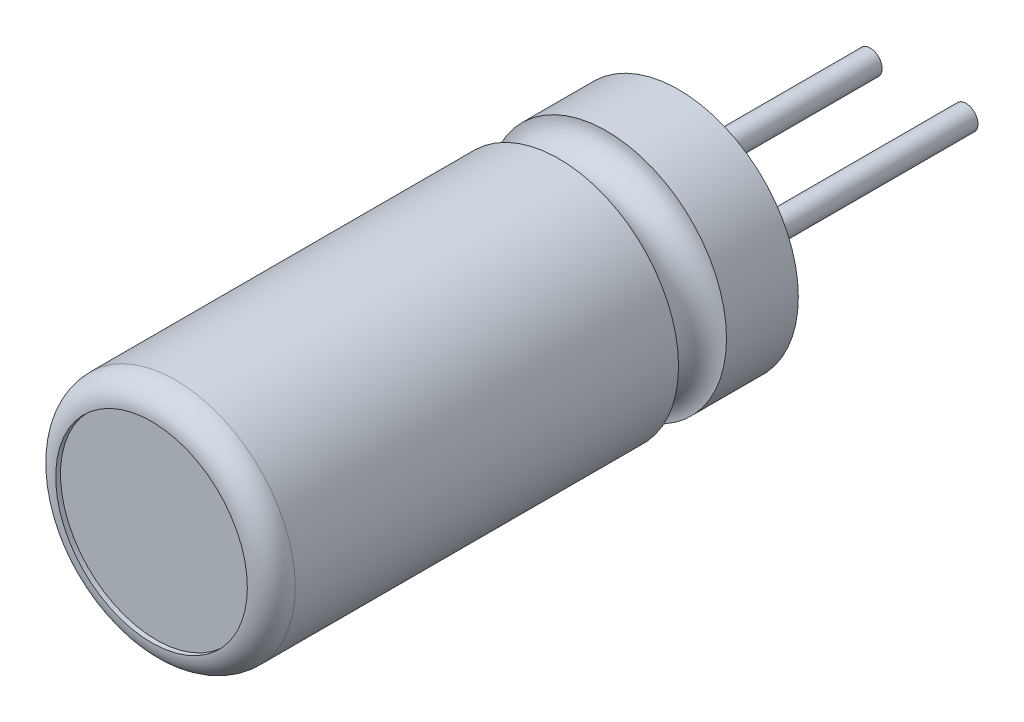
ISO-10303-21;
HEADER;
FILE_DESCRIPTION(('STEP AP214'),'2;1');
FILE_NAME('part.step','',(''),(''),'','','');
FILE_SCHEMA(('AUTOMOTIVE_DESIGN { 1 0 10303 214 1 1 1 1 }'));
ENDSEC;
DATA;
#1=APPLICATION_CONTEXT('core data for automotive mechanical design processes');
#2=APPLICATION_PROTOCOL_DEFINITION('international standard','automotive_design',2000,#1);
#3=PRODUCT_CONTEXT('',#1,'mechanical');
#4=PRODUCT('Part','Part','',(#3));
#5=PRODUCT_RELATED_PRODUCT_CATEGORY('part','',(#4));
#6=PRODUCT_DEFINITION_FORMATION('','',#4);
#7=PRODUCT_DEFINITION_CONTEXT('part definition',#1,'design');
#8=PRODUCT_DEFINITION('design','',#6,#7);
#9=PRODUCT_DEFINITION_SHAPE('','',#8);
#10=(LENGTH_UNIT() NAMED_UNIT(*) SI_UNIT(.MILLI.,.METRE.));
#11=(NAMED_UNIT(*) PLANE_ANGLE_UNIT() SI_UNIT($,.RADIAN.));
#12=(NAMED_UNIT(*) SI_UNIT($,.STERADIAN.) SOLID_ANGLE_UNIT());
#13=UNCERTAINTY_MEASURE_WITH_UNIT(LENGTH_MEASURE(1.E-05),#10,'distance_accuracy_value','');
#14=(GEOMETRIC_REPRESENTATION_CONTEXT(3) GLOBAL_UNCERTAINTY_ASSIGNED_CONTEXT((#13)) GLOBAL_UNIT_ASSIGNED_CONTEXT((#10,
#11,#12)) REPRESENTATION_CONTEXT('',''));
#15=CARTESIAN_POINT('',(0.,0.,0.));
#16=DIRECTION('',(0.,0.,1.));
#17=DIRECTION('',(1.,0.,0.));
#18=AXIS2_PLACEMENT_3D('',#15,#16,#17);
#19=CARTESIAN_POINT('',(0.,0.,0.));
#20=DIRECTION('',(0.,0.,1.));
#21=DIRECTION('',(1.,0.,0.));
#22=AXIS2_PLACEMENT_3D('',#19,#20,#21);
#23=PLANE('',#22);
#24=CARTESIAN_POINT('',(-1.,0.,0.));
#25=DIRECTION('',(0.,0.,1.));
#26=DIRECTION('',(1.,0.,0.));
#27=AXIS2_PLACEMENT_3D('',#24,#25,#26);
#28=CIRCLE('',#27,0.25);
#29=CARTESIAN_POINT('',(-0.75,0.,0.));
#30=VERTEX_POINT('',#29);
#31=EDGE_CURVE('E37',#30,#30,#28,.F.);
#32=ORIENTED_EDGE('',*,*,#31,.F.);
#33=EDGE_LOOP('',(#32));
#34=FACE_BOUND('',#33,.T.);
#35=CARTESIAN_POINT('',(0.,0.,0.));
#36=DIRECTION('',(0.,0.,1.));
#37=DIRECTION('',(1.,0.,0.));
#38=AXIS2_PLACEMENT_3D('',#35,#36,#37);
#39=CIRCLE('',#38,2.5);
#40=CARTESIAN_POINT('',(2.5,0.,0.));
#41=VERTEX_POINT('',#40);
#42=EDGE_CURVE('E41',#41,#41,#39,.T.);
#43=ORIENTED_EDGE('',*,*,#42,.F.);
#44=EDGE_LOOP('',(#43));
#45=FACE_BOUND('',#44,.T.);
#46=CARTESIAN_POINT('',(1.,0.,0.));
#47=DIRECTION('',(0.,0.,1.));
#48=DIRECTION('',(1.,0.,0.));
#49=AXIS2_PLACEMENT_3D('',#46,#47,#48);
#50=CIRCLE('',#49,0.25);
#51=CARTESIAN_POINT('',(1.25,0.,0.));
#52=VERTEX_POINT('',#51);
#53=EDGE_CURVE('E10',#52,#52,#50,.F.);
#54=ORIENTED_EDGE('',*,*,#53,.F.);
#55=EDGE_LOOP('',(#54));
#56=FACE_BOUND('',#55,.T.);
#57=ADVANCED_FACE('F31',(#34,#45,#56),#23,.F.);
#58=CARTESIAN_POINT('',(0.,0.,11.));
#59=DIRECTION('',(0.,0.,1.));
#60=DIRECTION('',(1.,0.,0.));
#61=AXIS2_PLACEMENT_3D('',#58,#59,#60);
#62=CYLINDRICAL_SURFACE('',#61,2.5);
#63=CARTESIAN_POINT('',(0.,0.,1.5));
#64=DIRECTION('',(0.,0.,1.));
#65=DIRECTION('',(1.,0.,0.));
#66=AXIS2_PLACEMENT_3D('',#63,#64,#65);
#67=CIRCLE('',#66,2.5);
#68=CARTESIAN_POINT('',(2.5,0.,1.5));
#69=VERTEX_POINT('',#68);
#70=EDGE_CURVE('E45',#69,#69,#67,.T.);
#71=ORIENTED_EDGE('',*,*,#70,.F.);
#72=EDGE_LOOP('',(#71));
#73=FACE_BOUND('',#72,.T.);
#74=ORIENTED_EDGE('',*,*,#42,.T.);
#75=EDGE_LOOP('',(#74));
#76=FACE_BOUND('',#75,.T.);
#77=ADVANCED_FACE('F84',(#73,#76),#62,.T.);
#78=CARTESIAN_POINT('',(0.,0.,2.));
#79=DIRECTION('',(0.,0.,1.));
#80=DIRECTION('',(1.,0.,0.));
#81=AXIS2_PLACEMENT_3D('',#78,#79,#80);
#82=TOROIDAL_SURFACE('',#81,2.5,0.5);
#83=CARTESIAN_POINT('',(0.,0.,2.5));
#84=DIRECTION('',(0.,0.,1.));
#85=DIRECTION('',(1.,0.,0.));
#86=AXIS2_PLACEMENT_3D('',#83,#84,#85);
#87=CIRCLE('',#86,2.5);
#88=CARTESIAN_POINT('',(2.5,0.,2.5));
#89=VERTEX_POINT('',#88);
#90=EDGE_CURVE('E50',#89,#89,#87,.T.);
#91=ORIENTED_EDGE('',*,*,#90,.F.);
#92=EDGE_LOOP('',(#91));
#93=FACE_BOUND('',#92,.T.);
#94=ORIENTED_EDGE('',*,*,#70,.T.);
#95=EDGE_LOOP('',(#94));
#96=FACE_BOUND('',#95,.T.);
#97=ADVANCED_FACE('F89',(#93,#96),#82,.F.);
#98=CARTESIAN_POINT('',(0.,0.,11.));
#99=DIRECTION('',(0.,0.,1.));
#100=DIRECTION('',(1.,0.,0.));
#101=AXIS2_PLACEMENT_3D('',#98,#99,#100);
#102=CYLINDRICAL_SURFACE('',#101,2.5);
#103=CARTESIAN_POINT('',(0.,0.,10.5));
#104=DIRECTION('',(0.,0.,1.));
#105=DIRECTION('',(1.,0.,0.));
#106=AXIS2_PLACEMENT_3D('',#103,#104,#105);
#107=CIRCLE('',#106,2.5);
#108=CARTESIAN_POINT('',(2.5,0.,10.5));
#109=VERTEX_POINT('',#108);
#110=EDGE_CURVE('E53',#109,#109,#107,.T.);
#111=ORIENTED_EDGE('',*,*,#110,.F.);
#112=EDGE_LOOP('',(#111));
#113=FACE_BOUND('',#112,.T.);
#114=ORIENTED_EDGE('',*,*,#90,.T.);
#115=EDGE_LOOP('',(#114));
#116=FACE_BOUND('',#115,.T.);
#117=ADVANCED_FACE('F98',(#113,#116),#102,.T.);
#118=CARTESIAN_POINT('',(0.,0.,10.5));
#119=DIRECTION('',(0.,0.,1.));
#120=DIRECTION('',(1.,0.,0.));
#121=AXIS2_PLACEMENT_3D('',#118,#119,#120);
#122=TOROIDAL_SURFACE('',#121,2.,0.500000000000001);
#123=CARTESIAN_POINT('',(0.,0.,11.));
#124=DIRECTION('',(0.,0.,1.));
#125=DIRECTION('',(1.,0.,0.));
#126=AXIS2_PLACEMENT_3D('',#123,#124,#125);
#127=CIRCLE('',#126,2.);
#128=CARTESIAN_POINT('',(2.,0.,11.));
#129=VERTEX_POINT('',#128);
#130=EDGE_CURVE('E57',#129,#129,#127,.T.);
#131=ORIENTED_EDGE('',*,*,#130,.F.);
#132=EDGE_LOOP('',(#131));
#133=FACE_BOUND('',#132,.T.);
#134=ORIENTED_EDGE('',*,*,#110,.T.);
#135=EDGE_LOOP('',(#134));
#136=FACE_BOUND('',#135,.T.);
#137=ADVANCED_FACE('F105',(#133,#136),#122,.T.);
#138=CARTESIAN_POINT('',(0.,0.,10.9));
#139=DIRECTION('',(0.,0.,1.));
#140=DIRECTION('',(1.,0.,0.));
#141=AXIS2_PLACEMENT_3D('',#138,#139,#140);
#142=CYLINDRICAL_SURFACE('',#141,2.);
#143=CARTESIAN_POINT('',(0.,0.,10.9));
#144=DIRECTION('',(0.,0.,1.));
#145=DIRECTION('',(1.,0.,0.));
#146=AXIS2_PLACEMENT_3D('',#143,#144,#145);
#147=CIRCLE('',#146,2.);
#148=CARTESIAN_POINT('',(2.,0.,10.9));
#149=VERTEX_POINT('',#148);
#150=EDGE_CURVE('E56',#149,#149,#147,.T.);
#151=ORIENTED_EDGE('',*,*,#150,.F.);
#152=EDGE_LOOP('',(#151));
#153=FACE_BOUND('',#152,.T.);
#154=ORIENTED_EDGE('',*,*,#130,.T.);
#155=EDGE_LOOP('',(#154));
#156=FACE_BOUND('',#155,.T.);
#157=ADVANCED_FACE('F109',(#153,#156),#142,.F.);
#158=CARTESIAN_POINT('',(0.,0.,10.9));
#159=DIRECTION('',(0.,0.,1.));
#160=DIRECTION('',(1.,0.,0.));
#161=AXIS2_PLACEMENT_3D('',#158,#159,#160);
#162=PLANE('',#161);
#163=ORIENTED_EDGE('',*,*,#150,.T.);
#164=EDGE_LOOP('',(#163));
#165=FACE_BOUND('',#164,.T.);
#166=ADVANCED_FACE('F113',(#165),#162,.T.);
#167=CARTESIAN_POINT('',(-1.,0.,-5.));
#168=DIRECTION('',(0.,0.,1.));
#169=DIRECTION('',(1.,0.,0.));
#170=AXIS2_PLACEMENT_3D('',#167,#168,#169);
#171=CYLINDRICAL_SURFACE('',#170,0.25);
#172=CARTESIAN_POINT('',(-1.,0.,-5.));
#173=DIRECTION('',(0.,0.,-1.));
#174=DIRECTION('',(-1.,0.,0.));
#175=AXIS2_PLACEMENT_3D('',#172,#173,#174);
#176=CIRCLE('',#175,0.25);
#177=CARTESIAN_POINT('',(-1.25,0.,-5.));
#178=VERTEX_POINT('',#177);
#179=EDGE_CURVE('E60',#178,#178,#176,.T.);
#180=ORIENTED_EDGE('',*,*,#179,.F.);
#181=EDGE_LOOP('',(#180));
#182=FACE_BOUND('',#181,.T.);
#183=ORIENTED_EDGE('',*,*,#31,.T.);
#184=EDGE_LOOP('',(#183));
#185=FACE_BOUND('',#184,.T.);
#186=ADVANCED_FACE('F80',(#182,#185),#171,.T.);
#187=CARTESIAN_POINT('',(-1.,0.,-5.));
#188=DIRECTION('',(0.,0.,-1.));
#189=DIRECTION('',(-1.,0.,0.));
#190=AXIS2_PLACEMENT_3D('',#187,#188,#189);
#191=PLANE('',#190);
#192=ORIENTED_EDGE('',*,*,#179,.T.);
#193=EDGE_LOOP('',(#192));
#194=FACE_BOUND('',#193,.T.);
#195=ADVANCED_FACE('F73',(#194),#191,.T.);
#196=CARTESIAN_POINT('',(1.,0.,-5.));
#197=DIRECTION('',(0.,0.,1.));
#198=DIRECTION('',(1.,0.,0.));
#199=AXIS2_PLACEMENT_3D('',#196,#197,#198);
#200=CYLINDRICAL_SURFACE('',#199,0.25);
#201=CARTESIAN_POINT('',(1.,0.,-5.));
#202=DIRECTION('',(0.,0.,-1.));
#203=DIRECTION('',(-1.,0.,0.));
#204=AXIS2_PLACEMENT_3D('',#201,#202,#203);
#205=CIRCLE('',#204,0.25);
#206=CARTESIAN_POINT('',(0.75,0.,-5.));
#207=VERTEX_POINT('',#206);
#208=EDGE_CURVE('E65',#207,#207,#205,.T.);
#209=ORIENTED_EDGE('',*,*,#208,.F.);
#210=EDGE_LOOP('',(#209));
#211=FACE_BOUND('',#210,.T.);
#212=ORIENTED_EDGE('',*,*,#53,.T.);
#213=EDGE_LOOP('',(#212));
#214=FACE_BOUND('',#213,.T.);
#215=ADVANCED_FACE('F71',(#211,#214),#200,.T.);
#216=CARTESIAN_POINT('',(1.,0.,-5.));
#217=DIRECTION('',(0.,0.,-1.));
#218=DIRECTION('',(-1.,0.,0.));
#219=AXIS2_PLACEMENT_3D('',#216,#217,#218);
#220=PLANE('',#219);
#221=ORIENTED_EDGE('',*,*,#208,.T.);
#222=EDGE_LOOP('',(#221));
#223=FACE_BOUND('',#222,.T.);
#224=ADVANCED_FACE('F69',(#223),#220,.T.);
#225=CLOSED_SHELL('',(#57,#77,#97,#117,#137,#157,#166,#186,#195,#215,#224));
#226=MANIFOLD_SOLID_BREP('B2',#225);
#227=ADVANCED_BREP_SHAPE_REPRESENTATION('',(#18,#226),#14);
#228=SHAPE_DEFINITION_REPRESENTATION(#9,#227);
ENDSEC;
END-ISO-10303-21;
